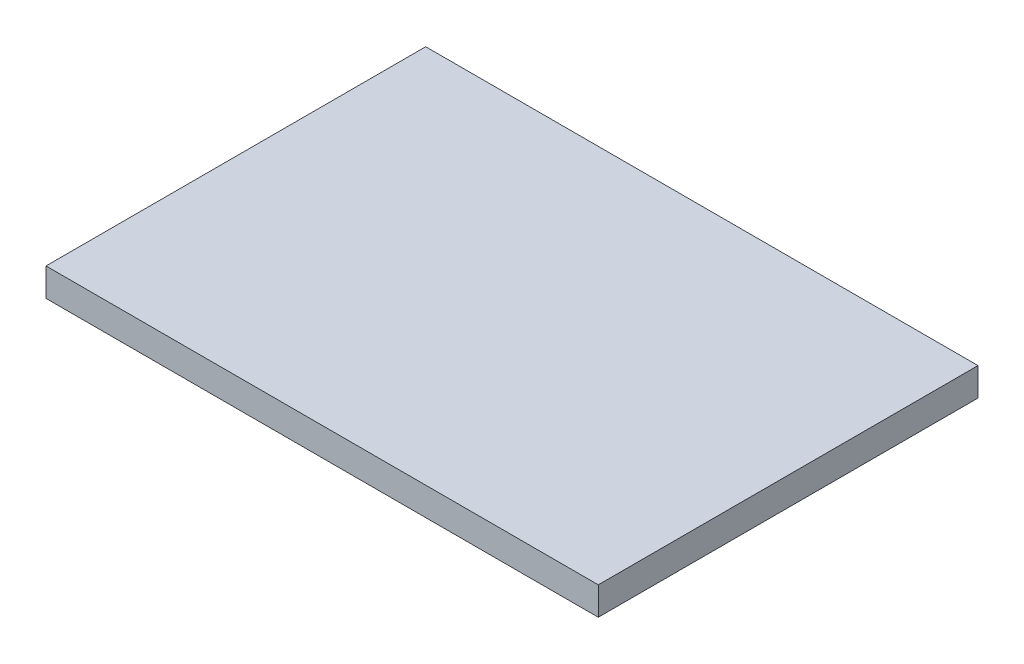
ISO-10303-21;
HEADER;
FILE_DESCRIPTION(('STEP AP214'),'2;1');
FILE_NAME('part.step','',(''),(''),'','','');
FILE_SCHEMA(('AUTOMOTIVE_DESIGN { 1 0 10303 214 1 1 1 1 }'));
ENDSEC;
DATA;
#1=APPLICATION_CONTEXT('core data for automotive mechanical design processes');
#2=APPLICATION_PROTOCOL_DEFINITION('international standard','automotive_design',2000,#1);
#3=PRODUCT_CONTEXT('',#1,'mechanical');
#4=PRODUCT('Part','Part','',(#3));
#5=PRODUCT_RELATED_PRODUCT_CATEGORY('part','',(#4));
#6=PRODUCT_DEFINITION_FORMATION('','',#4);
#7=PRODUCT_DEFINITION_CONTEXT('part definition',#1,'design');
#8=PRODUCT_DEFINITION('design','',#6,#7);
#9=PRODUCT_DEFINITION_SHAPE('','',#8);
#10=(LENGTH_UNIT() NAMED_UNIT(*) SI_UNIT(.MILLI.,.METRE.));
#11=(NAMED_UNIT(*) PLANE_ANGLE_UNIT() SI_UNIT($,.RADIAN.));
#12=(NAMED_UNIT(*) SI_UNIT($,.STERADIAN.) SOLID_ANGLE_UNIT());
#13=UNCERTAINTY_MEASURE_WITH_UNIT(LENGTH_MEASURE(1.E-05),#10,'distance_accuracy_value','');
#14=(GEOMETRIC_REPRESENTATION_CONTEXT(3) GLOBAL_UNCERTAINTY_ASSIGNED_CONTEXT((#13)) GLOBAL_UNIT_ASSIGNED_CONTEXT((#10,
#11,#12)) REPRESENTATION_CONTEXT('',''));
#15=CARTESIAN_POINT('',(0.,0.,0.));
#16=DIRECTION('',(0.,0.,1.));
#17=DIRECTION('',(1.,0.,0.));
#18=AXIS2_PLACEMENT_3D('',#15,#16,#17);
#19=CARTESIAN_POINT('',(-21.4827595754949,2.,0.));
#20=DIRECTION('',(1.,0.,0.));
#21=DIRECTION('',(0.,0.,-1.));
#22=AXIS2_PLACEMENT_3D('',#19,#20,#21);
#23=PLANE('',#22);
#24=DIRECTION('',(0.,0.,1.));
#25=VECTOR('',#24,1.);
#26=CARTESIAN_POINT('',(-21.4827595754949,0.,0.));
#27=LINE('',#26,#25);
#28=CARTESIAN_POINT('',(-21.4827595754949,0.,-27.));
#29=VERTEX_POINT('',#28);
#30=CARTESIAN_POINT('',(-21.4827595754949,0.,0.));
#31=VERTEX_POINT('',#30);
#32=EDGE_CURVE('E107',#29,#31,#27,.T.);
#33=ORIENTED_EDGE('',*,*,#32,.T.);
#34=DIRECTION('',(0.,-1.,0.));
#35=VECTOR('',#34,1.);
#36=CARTESIAN_POINT('',(-21.4827595754949,2.,0.));
#37=LINE('',#36,#35);
#38=CARTESIAN_POINT('',(-21.4827595754949,2.,0.));
#39=VERTEX_POINT('',#38);
#40=EDGE_CURVE('E11',#39,#31,#37,.T.);
#41=ORIENTED_EDGE('',*,*,#40,.F.);
#42=DIRECTION('',(0.,0.,1.));
#43=VECTOR('',#42,1.);
#44=CARTESIAN_POINT('',(-21.4827595754949,2.,0.));
#45=LINE('',#44,#43);
#46=CARTESIAN_POINT('',(-21.4827595754949,2.,-27.));
#47=VERTEX_POINT('',#46);
#48=EDGE_CURVE('E91',#47,#39,#45,.T.);
#49=ORIENTED_EDGE('',*,*,#48,.F.);
#50=DIRECTION('',(0.,-1.,0.));
#51=VECTOR('',#50,1.);
#52=CARTESIAN_POINT('',(-21.4827595754949,2.,-27.));
#53=LINE('',#52,#51);
#54=EDGE_CURVE('E103',#47,#29,#53,.T.);
#55=ORIENTED_EDGE('',*,*,#54,.T.);
#56=EDGE_LOOP('',(#33,#41,#49,#55));
#57=FACE_BOUND('',#56,.T.);
#58=ADVANCED_FACE('F39',(#57),#23,.F.);
#59=CARTESIAN_POINT('',(17.7871485943775,2.,0.));
#60=DIRECTION('',(0.,0.,-1.));
#61=DIRECTION('',(-1.,0.,0.));
#62=AXIS2_PLACEMENT_3D('',#59,#60,#61);
#63=PLANE('',#62);
#64=DIRECTION('',(1.,0.,0.));
#65=VECTOR('',#64,1.);
#66=CARTESIAN_POINT('',(17.7871485943775,0.,0.));
#67=LINE('',#66,#65);
#68=CARTESIAN_POINT('',(17.7871485943775,0.,0.));
#69=VERTEX_POINT('',#68);
#70=EDGE_CURVE('E96',#31,#69,#67,.T.);
#71=ORIENTED_EDGE('',*,*,#70,.T.);
#72=DIRECTION('',(0.,-1.,0.));
#73=VECTOR('',#72,1.);
#74=CARTESIAN_POINT('',(17.7871485943775,2.,0.));
#75=LINE('',#74,#73);
#76=CARTESIAN_POINT('',(17.7871485943775,2.,0.));
#77=VERTEX_POINT('',#76);
#78=EDGE_CURVE('E48',#77,#69,#75,.T.);
#79=ORIENTED_EDGE('',*,*,#78,.F.);
#80=DIRECTION('',(1.,0.,0.));
#81=VECTOR('',#80,1.);
#82=CARTESIAN_POINT('',(17.7871485943775,2.,0.));
#83=LINE('',#82,#81);
#84=EDGE_CURVE('E86',#39,#77,#83,.T.);
#85=ORIENTED_EDGE('',*,*,#84,.F.);
#86=ORIENTED_EDGE('',*,*,#40,.T.);
#87=EDGE_LOOP('',(#71,#79,#85,#86));
#88=FACE_BOUND('',#87,.T.);
#89=ADVANCED_FACE('F95',(#88),#63,.F.);
#90=CARTESIAN_POINT('',(17.7871485943775,2.,-27.));
#91=DIRECTION('',(-1.,0.,0.));
#92=DIRECTION('',(0.,0.,1.));
#93=AXIS2_PLACEMENT_3D('',#90,#91,#92);
#94=PLANE('',#93);
#95=DIRECTION('',(0.,0.,-1.));
#96=VECTOR('',#95,1.);
#97=CARTESIAN_POINT('',(17.7871485943775,0.,-27.));
#98=LINE('',#97,#96);
#99=CARTESIAN_POINT('',(17.7871485943775,0.,-27.));
#100=VERTEX_POINT('',#99);
#101=EDGE_CURVE('E73',#69,#100,#98,.T.);
#102=ORIENTED_EDGE('',*,*,#101,.T.);
#103=DIRECTION('',(0.,-1.,0.));
#104=VECTOR('',#103,1.);
#105=CARTESIAN_POINT('',(17.7871485943775,2.,-27.));
#106=LINE('',#105,#104);
#107=CARTESIAN_POINT('',(17.7871485943775,2.,-27.));
#108=VERTEX_POINT('',#107);
#109=EDGE_CURVE('E98',#108,#100,#106,.T.);
#110=ORIENTED_EDGE('',*,*,#109,.F.);
#111=DIRECTION('',(0.,0.,-1.));
#112=VECTOR('',#111,1.);
#113=CARTESIAN_POINT('',(17.7871485943775,2.,-27.));
#114=LINE('',#113,#112);
#115=EDGE_CURVE('E89',#77,#108,#114,.T.);
#116=ORIENTED_EDGE('',*,*,#115,.F.);
#117=ORIENTED_EDGE('',*,*,#78,.T.);
#118=EDGE_LOOP('',(#102,#110,#116,#117));
#119=FACE_BOUND('',#118,.T.);
#120=ADVANCED_FACE('F99',(#119),#94,.F.);
#121=CARTESIAN_POINT('',(-21.4827595754949,2.,-27.));
#122=DIRECTION('',(0.,0.,1.));
#123=DIRECTION('',(1.,0.,0.));
#124=AXIS2_PLACEMENT_3D('',#121,#122,#123);
#125=PLANE('',#124);
#126=DIRECTION('',(-1.,0.,0.));
#127=VECTOR('',#126,1.);
#128=CARTESIAN_POINT('',(-21.4827595754949,0.,-27.));
#129=LINE('',#128,#127);
#130=EDGE_CURVE('E79',#100,#29,#129,.T.);
#131=ORIENTED_EDGE('',*,*,#130,.T.);
#132=ORIENTED_EDGE('',*,*,#54,.F.);
#133=DIRECTION('',(-1.,0.,0.));
#134=VECTOR('',#133,1.);
#135=CARTESIAN_POINT('',(-21.4827595754949,2.,-27.));
#136=LINE('',#135,#134);
#137=EDGE_CURVE('E56',#108,#47,#136,.T.);
#138=ORIENTED_EDGE('',*,*,#137,.F.);
#139=ORIENTED_EDGE('',*,*,#109,.T.);
#140=EDGE_LOOP('',(#131,#132,#138,#139));
#141=FACE_BOUND('',#140,.T.);
#142=ADVANCED_FACE('F120',(#141),#125,.F.);
#143=CARTESIAN_POINT('',(0.,2.,0.));
#144=DIRECTION('',(0.,-1.,0.));
#145=DIRECTION('',(0.,0.,-1.));
#146=AXIS2_PLACEMENT_3D('',#143,#144,#145);
#147=PLANE('',#146);
#148=ORIENTED_EDGE('',*,*,#48,.T.);
#149=ORIENTED_EDGE('',*,*,#84,.T.);
#150=ORIENTED_EDGE('',*,*,#115,.T.);
#151=ORIENTED_EDGE('',*,*,#137,.T.);
#152=EDGE_LOOP('',(#148,#149,#150,#151));
#153=FACE_BOUND('',#152,.T.);
#154=ADVANCED_FACE('F87',(#153),#147,.F.);
#155=CARTESIAN_POINT('',(0.,0.,0.));
#156=DIRECTION('',(0.,-1.,0.));
#157=DIRECTION('',(0.,0.,-1.));
#158=AXIS2_PLACEMENT_3D('',#155,#156,#157);
#159=PLANE('',#158);
#160=ORIENTED_EDGE('',*,*,#32,.F.);
#161=ORIENTED_EDGE('',*,*,#130,.F.);
#162=ORIENTED_EDGE('',*,*,#101,.F.);
#163=ORIENTED_EDGE('',*,*,#70,.F.);
#164=EDGE_LOOP('',(#160,#161,#162,#163));
#165=FACE_BOUND('',#164,.T.);
#166=ADVANCED_FACE('F123',(#165),#159,.T.);
#167=CLOSED_SHELL('',(#58,#89,#120,#142,#154,#166));
#168=MANIFOLD_SOLID_BREP('B2',#167);
#169=ADVANCED_BREP_SHAPE_REPRESENTATION('',(#18,#168),#14);
#170=SHAPE_DEFINITION_REPRESENTATION(#9,#169);
ENDSEC;
END-ISO-10303-21;
